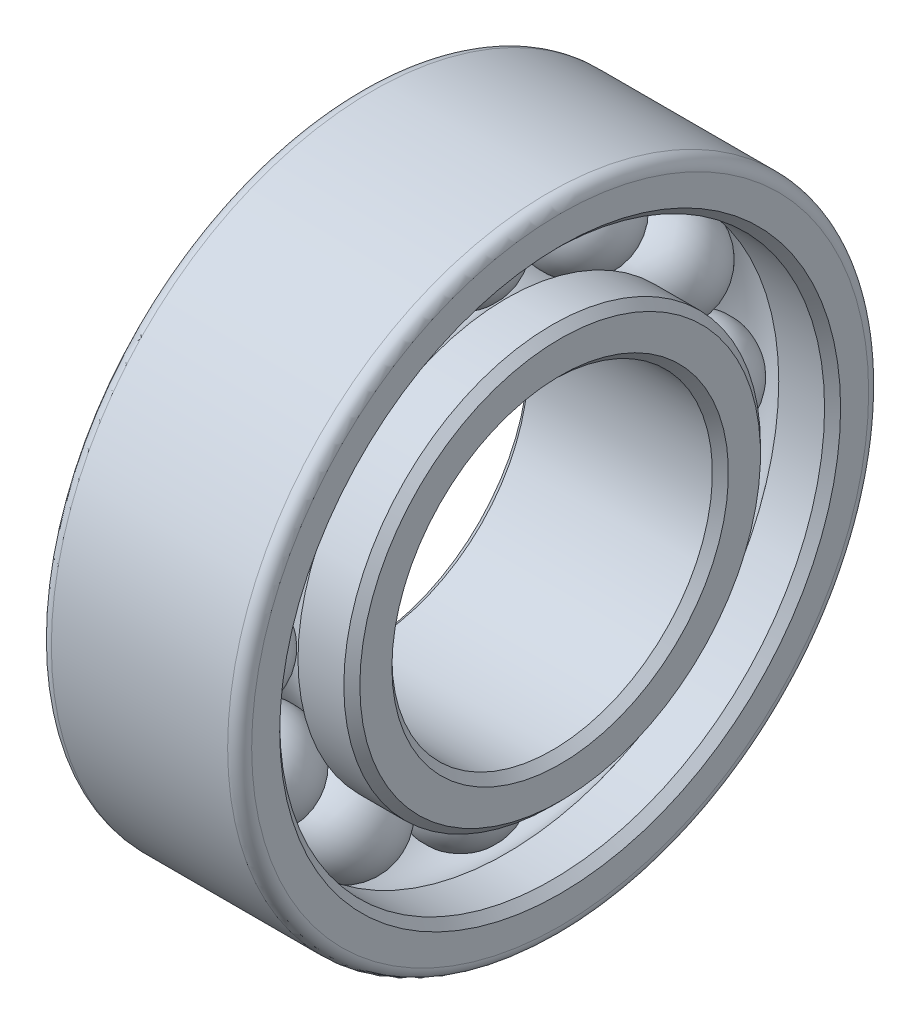
ISO-10303-21;
HEADER;
FILE_DESCRIPTION(('STEP AP214'),'2;1');
FILE_NAME('part.step','',(''),(''),'','','');
FILE_SCHEMA(('AUTOMOTIVE_DESIGN { 1 0 10303 214 1 1 1 1 }'));
ENDSEC;
DATA;
#1=APPLICATION_CONTEXT('core data for automotive mechanical design processes');
#2=APPLICATION_PROTOCOL_DEFINITION('international standard','automotive_design',2000,#1);
#3=PRODUCT_CONTEXT('',#1,'mechanical');
#4=PRODUCT('Part','Part','',(#3));
#5=PRODUCT_RELATED_PRODUCT_CATEGORY('part','',(#4));
#6=PRODUCT_DEFINITION_FORMATION('','',#4);
#7=PRODUCT_DEFINITION_CONTEXT('part definition',#1,'design');
#8=PRODUCT_DEFINITION('design','',#6,#7);
#9=PRODUCT_DEFINITION_SHAPE('','',#8);
#10=(LENGTH_UNIT() NAMED_UNIT(*) SI_UNIT(.MILLI.,.METRE.));
#11=(NAMED_UNIT(*) PLANE_ANGLE_UNIT() SI_UNIT($,.RADIAN.));
#12=(NAMED_UNIT(*) SI_UNIT($,.STERADIAN.) SOLID_ANGLE_UNIT());
#13=UNCERTAINTY_MEASURE_WITH_UNIT(LENGTH_MEASURE(1.E-05),#10,'distance_accuracy_value','');
#14=(GEOMETRIC_REPRESENTATION_CONTEXT(3) GLOBAL_UNCERTAINTY_ASSIGNED_CONTEXT((#13)) GLOBAL_UNIT_ASSIGNED_CONTEXT((#10,
#11,#12)) REPRESENTATION_CONTEXT('',''));
#15=CARTESIAN_POINT('',(0.,0.,0.));
#16=DIRECTION('',(0.,0.,1.));
#17=DIRECTION('',(1.,0.,0.));
#18=AXIS2_PLACEMENT_3D('',#15,#16,#17);
#19=CARTESIAN_POINT('',(2.51062289614978,1.06849757774923,2.9262984409004));
#20=DIRECTION('',(0.,0.866025403784445,0.499999999999989));
#21=DIRECTION('',(-1.,0.,0.));
#22=AXIS2_PLACEMENT_3D('',#19,#20,#21);
#23=SPHERICAL_SURFACE('',#22,1.25);
#24=CARTESIAN_POINT('',(2.51062289614978,2.15102933247978,3.55129844090038));
#25=VERTEX_POINT('',#24);
#26=VERTEX_LOOP('',#25);
#27=FACE_BOUND('',#26,.T.);
#28=ADVANCED_FACE('F39',(#27),#23,.T.);
#29=CLOSED_SHELL('',(#28));
#30=MANIFOLD_SOLID_BREP('B2',#29);
#31=CARTESIAN_POINT('',(2.51062289614978,-1.07370155909948,5.06849757774915));
#32=DIRECTION('',(0.,0.50000000000001,0.866025403784433));
#33=DIRECTION('',(-1.,0.,0.));
#34=AXIS2_PLACEMENT_3D('',#31,#32,#33);
#35=SPHERICAL_SURFACE('',#34,1.25);
#36=CARTESIAN_POINT('',(2.51062289614978,-0.448701559099468,6.1510293324797));
#37=VERTEX_POINT('',#36);
#38=VERTEX_LOOP('',#37);
#39=FACE_BOUND('',#38,.T.);
#40=ADVANCED_FACE('F59',(#39),#35,.T.);
#41=CLOSED_SHELL('',(#40));
#42=MANIFOLD_SOLID_BREP('B6',#41);
#43=CARTESIAN_POINT('',(2.51062289614978,-3.99999999999994,5.85259688180092));
#44=DIRECTION('',(0.,0.,1.));
#45=DIRECTION('',(-1.,0.,0.));
#46=AXIS2_PLACEMENT_3D('',#43,#44,#45);
#47=SPHERICAL_SURFACE('',#46,1.25);
#48=CARTESIAN_POINT('',(2.51062289614978,-3.99999999999993,7.10259688180092));
#49=VERTEX_POINT('',#48);
#50=VERTEX_LOOP('',#49);
#51=FACE_BOUND('',#50,.T.);
#52=ADVANCED_FACE('F79',(#51),#47,.T.);
#53=CLOSED_SHELL('',(#52));
#54=MANIFOLD_SOLID_BREP('B35',#53);
#55=CARTESIAN_POINT('',(2.51062289614978,-6.92629844090041,5.06849757774922));
#56=DIRECTION('',(0.,-0.499999999999992,0.866025403784443));
#57=DIRECTION('',(-1.,0.,0.));
#58=AXIS2_PLACEMENT_3D('',#55,#56,#57);
#59=SPHERICAL_SURFACE('',#58,1.25);
#60=CARTESIAN_POINT('',(2.51062289614978,-7.5512984409004,6.15102933247977));
#61=VERTEX_POINT('',#60);
#62=VERTEX_LOOP('',#61);
#63=FACE_BOUND('',#62,.T.);
#64=ADVANCED_FACE('F99',(#63),#59,.T.);
#65=CLOSED_SHELL('',(#64));
#66=MANIFOLD_SOLID_BREP('B55',#65);
#67=CARTESIAN_POINT('',(2.51062289614978,-9.06849757774916,2.9262984409005));
#68=DIRECTION('',(0.,-0.866025403784435,0.500000000000007));
#69=DIRECTION('',(-1.,0.,0.));
#70=AXIS2_PLACEMENT_3D('',#67,#68,#69);
#71=SPHERICAL_SURFACE('',#70,1.25);
#72=CARTESIAN_POINT('',(2.51062289614978,-10.1510293324797,3.55129844090051));
#73=VERTEX_POINT('',#72);
#74=VERTEX_LOOP('',#73);
#75=FACE_BOUND('',#74,.T.);
#76=ADVANCED_FACE('F119',(#75),#71,.T.);
#77=CLOSED_SHELL('',(#76));
#78=MANIFOLD_SOLID_BREP('B75',#77);
#79=CARTESIAN_POINT('',(2.51062289614978,-9.85259688180092,0.));
#80=DIRECTION('',(0.,-1.,0.));
#81=DIRECTION('',(-1.,0.,0.));
#82=AXIS2_PLACEMENT_3D('',#79,#80,#81);
#83=SPHERICAL_SURFACE('',#82,1.25);
#84=CARTESIAN_POINT('',(2.51062289614978,-11.1025968818009,0.));
#85=VERTEX_POINT('',#84);
#86=VERTEX_LOOP('',#85);
#87=FACE_BOUND('',#86,.T.);
#88=ADVANCED_FACE('F139',(#87),#83,.T.);
#89=CLOSED_SHELL('',(#88));
#90=MANIFOLD_SOLID_BREP('B95',#89);
#91=CARTESIAN_POINT('',(2.51062289614978,-9.06849757774921,-2.92629844090043));
#92=DIRECTION('',(0.,-0.866025403784442,-0.499999999999995));
#93=DIRECTION('',(-1.,0.,0.));
#94=AXIS2_PLACEMENT_3D('',#91,#92,#93);
#95=SPHERICAL_SURFACE('',#94,1.25);
#96=CARTESIAN_POINT('',(2.51062289614978,-10.1510293324798,-3.55129844090042));
#97=VERTEX_POINT('',#96);
#98=VERTEX_LOOP('',#97);
#99=FACE_BOUND('',#98,.T.);
#100=ADVANCED_FACE('F159',(#99),#95,.T.);
#101=CLOSED_SHELL('',(#100));
#102=MANIFOLD_SOLID_BREP('B115',#101);
#103=CARTESIAN_POINT('',(2.51062289614978,-6.92629844090048,-5.06849757774918));
#104=DIRECTION('',(0.,-0.500000000000004,-0.866025403784436));
#105=DIRECTION('',(-1.,0.,0.));
#106=AXIS2_PLACEMENT_3D('',#103,#104,#105);
#107=SPHERICAL_SURFACE('',#106,1.25);
#108=CARTESIAN_POINT('',(2.51062289614978,-7.55129844090049,-6.15102933247972));
#109=VERTEX_POINT('',#108);
#110=VERTEX_LOOP('',#109);
#111=FACE_BOUND('',#110,.T.);
#112=ADVANCED_FACE('F179',(#111),#107,.T.);
#113=CLOSED_SHELL('',(#112));
#114=MANIFOLD_SOLID_BREP('B135',#113);
#115=CARTESIAN_POINT('',(2.51062289614978,-4.00000000000002,-5.85259688180092));
#116=DIRECTION('',(0.,0.,-1.));
#117=DIRECTION('',(-1.,0.,0.));
#118=AXIS2_PLACEMENT_3D('',#115,#116,#117);
#119=SPHERICAL_SURFACE('',#118,1.25);
#120=CARTESIAN_POINT('',(2.51062289614978,-4.00000000000002,-7.10259688180092));
#121=VERTEX_POINT('',#120);
#122=VERTEX_LOOP('',#121);
#123=FACE_BOUND('',#122,.T.);
#124=ADVANCED_FACE('F199',(#123),#119,.T.);
#125=CLOSED_SHELL('',(#124));
#126=MANIFOLD_SOLID_BREP('B155',#125);
#127=CARTESIAN_POINT('',(2.51062289614978,-1.07370155909955,-5.0684975777492));
#128=DIRECTION('',(0.,0.499999999999998,-0.86602540378444));
#129=DIRECTION('',(-1.,0.,0.));
#130=AXIS2_PLACEMENT_3D('',#127,#128,#129);
#131=SPHERICAL_SURFACE('',#130,1.25);
#132=CARTESIAN_POINT('',(2.51062289614978,-0.448701559099554,-6.15102933247975));
#133=VERTEX_POINT('',#132);
#134=VERTEX_LOOP('',#133);
#135=FACE_BOUND('',#134,.T.);
#136=ADVANCED_FACE('F219',(#135),#131,.T.);
#137=CLOSED_SHELL('',(#136));
#138=MANIFOLD_SOLID_BREP('B175',#137);
#139=CARTESIAN_POINT('',(2.51062289614978,1.06849757774919,-2.92629844090047));
#140=DIRECTION('',(0.,0.866025403784438,-0.500000000000001));
#141=DIRECTION('',(-1.,0.,0.));
#142=AXIS2_PLACEMENT_3D('',#139,#140,#141);
#143=SPHERICAL_SURFACE('',#142,1.25);
#144=CARTESIAN_POINT('',(2.51062289614978,2.15102933247973,-3.55129844090047));
#145=VERTEX_POINT('',#144);
#146=VERTEX_LOOP('',#145);
#147=FACE_BOUND('',#146,.T.);
#148=ADVANCED_FACE('F239',(#147),#143,.T.);
#149=CLOSED_SHELL('',(#148));
#150=MANIFOLD_SOLID_BREP('B195',#149);
#151=CARTESIAN_POINT('',(2.51062289614978,1.85259688180092,0.));
#152=DIRECTION('',(0.,1.,0.));
#153=DIRECTION('',(-1.,0.,0.));
#154=AXIS2_PLACEMENT_3D('',#151,#152,#153);
#155=SPHERICAL_SURFACE('',#154,1.25);
#156=CARTESIAN_POINT('',(2.51062289614978,3.10259688180092,0.));
#157=VERTEX_POINT('',#156);
#158=VERTEX_LOOP('',#157);
#159=FACE_BOUND('',#158,.T.);
#160=ADVANCED_FACE('F261',(#159),#155,.T.);
#161=CLOSED_SHELL('',(#160));
#162=MANIFOLD_SOLID_BREP('B215',#161);
#163=CARTESIAN_POINT('',(0.,2.8,0.));
#164=DIRECTION('',(1.,0.,0.));
#165=DIRECTION('',(0.,0.,-1.));
#166=AXIS2_PLACEMENT_3D('',#163,#164,#165);
#167=PLANE('',#166);
#168=CARTESIAN_POINT('',(0.,-4.,0.));
#169=DIRECTION('',(1.,0.,0.));
#170=DIRECTION('',(0.,0.,-1.));
#171=AXIS2_PLACEMENT_3D('',#168,#169,#170);
#172=CIRCLE('',#171,7.);
#173=CARTESIAN_POINT('',(0.,-4.,-7.));
#174=VERTEX_POINT('',#173);
#175=EDGE_CURVE('E260',#174,#174,#172,.T.);
#176=ORIENTED_EDGE('',*,*,#175,.T.);
#177=EDGE_LOOP('',(#176));
#178=FACE_BOUND('',#177,.T.);
#179=CARTESIAN_POINT('',(0.,-4.,0.));
#180=DIRECTION('',(1.,0.,0.));
#181=DIRECTION('',(0.,0.,-1.));
#182=AXIS2_PLACEMENT_3D('',#179,#180,#181);
#183=CIRCLE('',#182,7.7);
#184=CARTESIAN_POINT('',(0.,-4.,-7.7));
#185=VERTEX_POINT('',#184);
#186=EDGE_CURVE('E300',#185,#185,#183,.F.);
#187=ORIENTED_EDGE('',*,*,#186,.T.);
#188=EDGE_LOOP('',(#187));
#189=FACE_BOUND('',#188,.T.);
#190=ADVANCED_FACE('F280',(#178,#189),#167,.F.);
#191=CARTESIAN_POINT('',(-1.0669014084507,-4.,0.));
#192=DIRECTION('',(-1.,0.,0.));
#193=DIRECTION('',(0.,0.,1.));
#194=AXIS2_PLACEMENT_3D('',#191,#192,#193);
#195=CYLINDRICAL_SURFACE('',#194,6.8);
#196=CARTESIAN_POINT('',(0.199999999999998,-4.,0.));
#197=DIRECTION('',(1.,0.,0.));
#198=DIRECTION('',(0.,0.,-1.));
#199=AXIS2_PLACEMENT_3D('',#196,#197,#198);
#200=CIRCLE('',#199,6.8);
#201=CARTESIAN_POINT('',(0.199999999999998,-4.,-6.8));
#202=VERTEX_POINT('',#201);
#203=EDGE_CURVE('E287',#202,#202,#200,.F.);
#204=ORIENTED_EDGE('',*,*,#203,.T.);
#205=EDGE_LOOP('',(#204));
#206=FACE_BOUND('',#205,.T.);
#207=CARTESIAN_POINT('',(1.36487620741247,-4.,0.));
#208=DIRECTION('',(-1.,0.,0.));
#209=DIRECTION('',(0.,0.,1.));
#210=AXIS2_PLACEMENT_3D('',#207,#208,#209);
#211=CIRCLE('',#210,6.8);
#212=CARTESIAN_POINT('',(1.36487620741247,-4.,6.8));
#213=VERTEX_POINT('',#212);
#214=EDGE_CURVE('E312',#213,#213,#211,.T.);
#215=ORIENTED_EDGE('',*,*,#214,.F.);
#216=EDGE_LOOP('',(#215));
#217=FACE_BOUND('',#216,.T.);
#218=ADVANCED_FACE('F324',(#206,#217),#195,.F.);
#219=CARTESIAN_POINT('',(2.51062289614978,-4.,0.));
#220=DIRECTION('',(-1.,0.,0.));
#221=DIRECTION('',(0.,0.,1.));
#222=AXIS2_PLACEMENT_3D('',#219,#220,#221);
#223=TOROIDAL_SURFACE('',#222,6.,1.39740311819908);
#224=CARTESIAN_POINT('',(3.65636958488709,-4.,0.));
#225=DIRECTION('',(-1.,0.,0.));
#226=DIRECTION('',(0.,0.,1.));
#227=AXIS2_PLACEMENT_3D('',#224,#225,#226);
#228=CIRCLE('',#227,6.8);
#229=CARTESIAN_POINT('',(3.65636958488709,-4.,6.8));
#230=VERTEX_POINT('',#229);
#231=EDGE_CURVE('E315',#230,#230,#228,.T.);
#232=ORIENTED_EDGE('',*,*,#231,.F.);
#233=EDGE_LOOP('',(#232));
#234=FACE_BOUND('',#233,.T.);
#235=ORIENTED_EDGE('',*,*,#214,.T.);
#236=EDGE_LOOP('',(#235));
#237=FACE_BOUND('',#236,.T.);
#238=ADVANCED_FACE('F321',(#234,#237),#223,.F.);
#239=CARTESIAN_POINT('',(-1.0669014084507,-4.,0.));
#240=DIRECTION('',(-1.,0.,0.));
#241=DIRECTION('',(0.,0.,1.));
#242=AXIS2_PLACEMENT_3D('',#239,#240,#241);
#243=CYLINDRICAL_SURFACE('',#242,6.8);
#244=CARTESIAN_POINT('',(4.8,-4.,0.));
#245=DIRECTION('',(-1.,0.,0.));
#246=DIRECTION('',(0.,0.,1.));
#247=AXIS2_PLACEMENT_3D('',#244,#245,#246);
#248=CIRCLE('',#247,6.8);
#249=CARTESIAN_POINT('',(4.8,-4.,6.8));
#250=VERTEX_POINT('',#249);
#251=EDGE_CURVE('E291',#250,#250,#248,.F.);
#252=ORIENTED_EDGE('',*,*,#251,.T.);
#253=EDGE_LOOP('',(#252));
#254=FACE_BOUND('',#253,.T.);
#255=ORIENTED_EDGE('',*,*,#231,.T.);
#256=EDGE_LOOP('',(#255));
#257=FACE_BOUND('',#256,.T.);
#258=ADVANCED_FACE('F319',(#254,#257),#243,.F.);
#259=CARTESIAN_POINT('',(5.,2.8,0.));
#260=DIRECTION('',(-1.,0.,0.));
#261=DIRECTION('',(0.,0.,1.));
#262=AXIS2_PLACEMENT_3D('',#259,#260,#261);
#263=PLANE('',#262);
#264=CARTESIAN_POINT('',(5.,-4.,0.));
#265=DIRECTION('',(-1.,0.,0.));
#266=DIRECTION('',(0.,0.,1.));
#267=AXIS2_PLACEMENT_3D('',#264,#265,#266);
#268=CIRCLE('',#267,7.);
#269=CARTESIAN_POINT('',(5.,-4.,7.));
#270=VERTEX_POINT('',#269);
#271=EDGE_CURVE('E295',#270,#270,#268,.T.);
#272=ORIENTED_EDGE('',*,*,#271,.T.);
#273=EDGE_LOOP('',(#272));
#274=FACE_BOUND('',#273,.T.);
#275=CARTESIAN_POINT('',(5.,-4.,0.));
#276=DIRECTION('',(-1.,0.,0.));
#277=DIRECTION('',(0.,0.,1.));
#278=AXIS2_PLACEMENT_3D('',#275,#276,#277);
#279=CIRCLE('',#278,7.7);
#280=CARTESIAN_POINT('',(5.,-4.,7.7));
#281=VERTEX_POINT('',#280);
#282=EDGE_CURVE('E303',#281,#281,#279,.F.);
#283=ORIENTED_EDGE('',*,*,#282,.T.);
#284=EDGE_LOOP('',(#283));
#285=FACE_BOUND('',#284,.T.);
#286=ADVANCED_FACE('F355',(#274,#285),#263,.F.);
#287=CARTESIAN_POINT('',(-1.0669014084507,-4.,0.));
#288=DIRECTION('',(-1.,0.,0.));
#289=DIRECTION('',(0.,0.,1.));
#290=AXIS2_PLACEMENT_3D('',#287,#288,#289);
#291=CYLINDRICAL_SURFACE('',#290,8.);
#292=CARTESIAN_POINT('',(4.7,-4.,0.));
#293=DIRECTION('',(-1.,0.,0.));
#294=DIRECTION('',(0.,0.,1.));
#295=AXIS2_PLACEMENT_3D('',#292,#293,#294);
#296=CIRCLE('',#295,8.);
#297=CARTESIAN_POINT('',(4.7,-4.,8.));
#298=VERTEX_POINT('',#297);
#299=EDGE_CURVE('E306',#298,#298,#296,.T.);
#300=ORIENTED_EDGE('',*,*,#299,.T.);
#301=EDGE_LOOP('',(#300));
#302=FACE_BOUND('',#301,.T.);
#303=CARTESIAN_POINT('',(0.3,-4.,0.));
#304=DIRECTION('',(1.,0.,0.));
#305=DIRECTION('',(0.,0.,-1.));
#306=AXIS2_PLACEMENT_3D('',#303,#304,#305);
#307=CIRCLE('',#306,8.);
#308=CARTESIAN_POINT('',(0.3,-4.,-8.));
#309=VERTEX_POINT('',#308);
#310=EDGE_CURVE('E309',#309,#309,#307,.T.);
#311=ORIENTED_EDGE('',*,*,#310,.T.);
#312=EDGE_LOOP('',(#311));
#313=FACE_BOUND('',#312,.T.);
#314=ADVANCED_FACE('F340',(#302,#313),#291,.T.);
#315=CARTESIAN_POINT('',(4.7,-4.,0.));
#316=DIRECTION('',(-1.,0.,0.));
#317=DIRECTION('',(0.,0.,1.));
#318=AXIS2_PLACEMENT_3D('',#315,#316,#317);
#319=TOROIDAL_SURFACE('',#318,7.7,0.3);
#320=ORIENTED_EDGE('',*,*,#282,.F.);
#321=EDGE_LOOP('',(#320));
#322=FACE_BOUND('',#321,.T.);
#323=ORIENTED_EDGE('',*,*,#299,.F.);
#324=EDGE_LOOP('',(#323));
#325=FACE_BOUND('',#324,.T.);
#326=ADVANCED_FACE('F336',(#322,#325),#319,.T.);
#327=CARTESIAN_POINT('',(0.3,-4.,0.));
#328=DIRECTION('',(1.,0.,0.));
#329=DIRECTION('',(0.,0.,-1.));
#330=AXIS2_PLACEMENT_3D('',#327,#328,#329);
#331=TOROIDAL_SURFACE('',#330,7.7,0.3);
#332=ORIENTED_EDGE('',*,*,#310,.F.);
#333=EDGE_LOOP('',(#332));
#334=FACE_BOUND('',#333,.T.);
#335=ORIENTED_EDGE('',*,*,#186,.F.);
#336=EDGE_LOOP('',(#335));
#337=FACE_BOUND('',#336,.T.);
#338=ADVANCED_FACE('F339',(#334,#337),#331,.T.);
#339=CARTESIAN_POINT('',(5.,-4.,0.));
#340=DIRECTION('',(1.,0.,0.));
#341=DIRECTION('',(0.,0.,-1.));
#342=AXIS2_PLACEMENT_3D('',#339,#340,#341);
#343=CONICAL_SURFACE('',#342,7.,0.785398163397442);
#344=ORIENTED_EDGE('',*,*,#251,.F.);
#345=EDGE_LOOP('',(#344));
#346=FACE_BOUND('',#345,.T.);
#347=ORIENTED_EDGE('',*,*,#271,.F.);
#348=EDGE_LOOP('',(#347));
#349=FACE_BOUND('',#348,.T.);
#350=ADVANCED_FACE('F343',(#346,#349),#343,.F.);
#351=CARTESIAN_POINT('',(0.199999999999998,-4.,0.));
#352=DIRECTION('',(-1.,0.,0.));
#353=DIRECTION('',(0.,0.,1.));
#354=AXIS2_PLACEMENT_3D('',#351,#352,#353);
#355=CONICAL_SURFACE('',#354,6.8,0.78539816339745);
#356=ORIENTED_EDGE('',*,*,#175,.F.);
#357=EDGE_LOOP('',(#356));
#358=FACE_BOUND('',#357,.T.);
#359=ORIENTED_EDGE('',*,*,#203,.F.);
#360=EDGE_LOOP('',(#359));
#361=FACE_BOUND('',#360,.T.);
#362=ADVANCED_FACE('F282',(#358,#361),#355,.F.);
#363=CLOSED_SHELL('',(#190,#218,#238,#258,#286,#314,#326,#338,#350,#362));
#364=MANIFOLD_SOLID_BREP('B235',#363);
#365=CARTESIAN_POINT('',(0.,0.,0.));
#366=DIRECTION('',(1.,0.,0.));
#367=DIRECTION('',(0.,0.,-1.));
#368=AXIS2_PLACEMENT_3D('',#365,#366,#367);
#369=PLANE('',#368);
#370=CARTESIAN_POINT('',(0.,-4.,0.));
#371=DIRECTION('',(1.,0.,0.));
#372=DIRECTION('',(0.,0.,-1.));
#373=AXIS2_PLACEMENT_3D('',#370,#371,#372);
#374=CIRCLE('',#373,4.2);
#375=CARTESIAN_POINT('',(0.,-4.,-4.2));
#376=VERTEX_POINT('',#375);
#377=EDGE_CURVE('E455',#376,#376,#374,.T.);
#378=ORIENTED_EDGE('',*,*,#377,.T.);
#379=EDGE_LOOP('',(#378));
#380=FACE_BOUND('',#379,.T.);
#381=CARTESIAN_POINT('',(0.,-4.,0.));
#382=DIRECTION('',(1.,0.,0.));
#383=DIRECTION('',(0.,0.,-1.));
#384=AXIS2_PLACEMENT_3D('',#381,#382,#383);
#385=CIRCLE('',#384,5.);
#386=CARTESIAN_POINT('',(0.,-4.,-5.));
#387=VERTEX_POINT('',#386);
#388=EDGE_CURVE('E458',#387,#387,#385,.F.);
#389=ORIENTED_EDGE('',*,*,#388,.T.);
#390=EDGE_LOOP('',(#389));
#391=FACE_BOUND('',#390,.T.);
#392=ADVANCED_FACE('F435',(#380,#391),#369,.F.);
#393=CARTESIAN_POINT('',(-1.0669014084507,-4.,0.));
#394=DIRECTION('',(-1.,0.,0.));
#395=DIRECTION('',(0.,0.,1.));
#396=AXIS2_PLACEMENT_3D('',#393,#394,#395);
#397=CYLINDRICAL_SURFACE('',#396,4.);
#398=CARTESIAN_POINT('',(0.200000000000001,-4.,0.));
#399=DIRECTION('',(1.,0.,0.));
#400=DIRECTION('',(0.,0.,-1.));
#401=AXIS2_PLACEMENT_3D('',#398,#399,#400);
#402=CIRCLE('',#401,4.);
#403=CARTESIAN_POINT('',(0.200000000000001,-4.,-4.));
#404=VERTEX_POINT('',#403);
#405=EDGE_CURVE('E461',#404,#404,#402,.F.);
#406=ORIENTED_EDGE('',*,*,#405,.T.);
#407=EDGE_LOOP('',(#406));
#408=FACE_BOUND('',#407,.T.);
#409=CARTESIAN_POINT('',(4.8,-4.,0.));
#410=DIRECTION('',(-1.,0.,0.));
#411=DIRECTION('',(0.,0.,1.));
#412=AXIS2_PLACEMENT_3D('',#409,#410,#411);
#413=CIRCLE('',#412,4.);
#414=CARTESIAN_POINT('',(4.8,-4.,4.));
#415=VERTEX_POINT('',#414);
#416=EDGE_CURVE('E464',#415,#415,#413,.F.);
#417=ORIENTED_EDGE('',*,*,#416,.T.);
#418=EDGE_LOOP('',(#417));
#419=FACE_BOUND('',#418,.T.);
#420=ADVANCED_FACE('F489',(#408,#419),#397,.F.);
#421=CARTESIAN_POINT('',(5.,0.,0.));
#422=DIRECTION('',(-1.,0.,0.));
#423=DIRECTION('',(0.,0.,1.));
#424=AXIS2_PLACEMENT_3D('',#421,#422,#423);
#425=PLANE('',#424);
#426=CARTESIAN_POINT('',(5.,-4.,0.));
#427=DIRECTION('',(-1.,0.,0.));
#428=DIRECTION('',(0.,0.,1.));
#429=AXIS2_PLACEMENT_3D('',#426,#427,#428);
#430=CIRCLE('',#429,4.2);
#431=CARTESIAN_POINT('',(5.,-4.,4.2));
#432=VERTEX_POINT('',#431);
#433=EDGE_CURVE('E446',#432,#432,#430,.T.);
#434=ORIENTED_EDGE('',*,*,#433,.T.);
#435=EDGE_LOOP('',(#434));
#436=FACE_BOUND('',#435,.T.);
#437=CARTESIAN_POINT('',(5.,-4.,0.));
#438=DIRECTION('',(-1.,0.,0.));
#439=DIRECTION('',(0.,0.,1.));
#440=AXIS2_PLACEMENT_3D('',#437,#438,#439);
#441=CIRCLE('',#440,5.);
#442=CARTESIAN_POINT('',(5.,-4.,5.));
#443=VERTEX_POINT('',#442);
#444=EDGE_CURVE('E450',#443,#443,#441,.F.);
#445=ORIENTED_EDGE('',*,*,#444,.T.);
#446=EDGE_LOOP('',(#445));
#447=FACE_BOUND('',#446,.T.);
#448=ADVANCED_FACE('F484',(#436,#447),#425,.F.);
#449=CARTESIAN_POINT('',(-1.0669014084507,-4.,0.));
#450=DIRECTION('',(-1.,0.,0.));
#451=DIRECTION('',(0.,0.,1.));
#452=AXIS2_PLACEMENT_3D('',#449,#450,#451);
#453=CYLINDRICAL_SURFACE('',#452,5.2);
#454=CARTESIAN_POINT('',(4.8,-4.,0.));
#455=DIRECTION('',(-1.,0.,0.));
#456=DIRECTION('',(0.,0.,1.));
#457=AXIS2_PLACEMENT_3D('',#454,#455,#456);
#458=CIRCLE('',#457,5.2);
#459=CARTESIAN_POINT('',(4.8,-4.,5.2));
#460=VERTEX_POINT('',#459);
#461=EDGE_CURVE('E442',#460,#460,#458,.T.);
#462=ORIENTED_EDGE('',*,*,#461,.T.);
#463=EDGE_LOOP('',(#462));
#464=FACE_BOUND('',#463,.T.);
#465=CARTESIAN_POINT('',(3.65636958488709,-4.,0.));
#466=DIRECTION('',(-1.,0.,0.));
#467=DIRECTION('',(0.,0.,1.));
#468=AXIS2_PLACEMENT_3D('',#465,#466,#467);
#469=CIRCLE('',#468,5.2);
#470=CARTESIAN_POINT('',(3.65636958488709,-4.,5.2));
#471=VERTEX_POINT('',#470);
#472=EDGE_CURVE('E467',#471,#471,#469,.T.);
#473=ORIENTED_EDGE('',*,*,#472,.F.);
#474=EDGE_LOOP('',(#473));
#475=FACE_BOUND('',#474,.T.);
#476=ADVANCED_FACE('F479',(#464,#475),#453,.T.);
#477=CARTESIAN_POINT('',(2.51062289614978,-4.,0.));
#478=DIRECTION('',(-1.,0.,0.));
#479=DIRECTION('',(0.,0.,1.));
#480=AXIS2_PLACEMENT_3D('',#477,#478,#479);
#481=TOROIDAL_SURFACE('',#480,6.,1.39740311819908);
#482=CARTESIAN_POINT('',(1.36487620741247,-4.,0.));
#483=DIRECTION('',(-1.,0.,0.));
#484=DIRECTION('',(0.,0.,1.));
#485=AXIS2_PLACEMENT_3D('',#482,#483,#484);
#486=CIRCLE('',#485,5.2);
#487=CARTESIAN_POINT('',(1.36487620741247,-4.,5.2));
#488=VERTEX_POINT('',#487);
#489=EDGE_CURVE('E470',#488,#488,#486,.T.);
#490=ORIENTED_EDGE('',*,*,#489,.F.);
#491=EDGE_LOOP('',(#490));
#492=FACE_BOUND('',#491,.T.);
#493=ORIENTED_EDGE('',*,*,#472,.T.);
#494=EDGE_LOOP('',(#493));
#495=FACE_BOUND('',#494,.T.);
#496=ADVANCED_FACE('F476',(#492,#495),#481,.F.);
#497=CARTESIAN_POINT('',(-1.0669014084507,-4.,0.));
#498=DIRECTION('',(-1.,0.,0.));
#499=DIRECTION('',(0.,0.,1.));
#500=AXIS2_PLACEMENT_3D('',#497,#498,#499);
#501=CYLINDRICAL_SURFACE('',#500,5.2);
#502=CARTESIAN_POINT('',(0.200000000000006,-4.,0.));
#503=DIRECTION('',(1.,0.,0.));
#504=DIRECTION('',(0.,0.,-1.));
#505=AXIS2_PLACEMENT_3D('',#502,#503,#504);
#506=CIRCLE('',#505,5.2);
#507=CARTESIAN_POINT('',(0.200000000000006,-4.,-5.2));
#508=VERTEX_POINT('',#507);
#509=EDGE_CURVE('E279',#508,#508,#506,.T.);
#510=ORIENTED_EDGE('',*,*,#509,.T.);
#511=EDGE_LOOP('',(#510));
#512=FACE_BOUND('',#511,.T.);
#513=ORIENTED_EDGE('',*,*,#489,.T.);
#514=EDGE_LOOP('',(#513));
#515=FACE_BOUND('',#514,.T.);
#516=ADVANCED_FACE('F474',(#512,#515),#501,.T.);
#517=CARTESIAN_POINT('',(0.200000000000001,-4.,0.));
#518=DIRECTION('',(-1.,0.,0.));
#519=DIRECTION('',(0.,0.,1.));
#520=AXIS2_PLACEMENT_3D('',#517,#518,#519);
#521=CONICAL_SURFACE('',#520,4.,0.785398163397448);
#522=ORIENTED_EDGE('',*,*,#377,.F.);
#523=EDGE_LOOP('',(#522));
#524=FACE_BOUND('',#523,.T.);
#525=ORIENTED_EDGE('',*,*,#405,.F.);
#526=EDGE_LOOP('',(#525));
#527=FACE_BOUND('',#526,.T.);
#528=ADVANCED_FACE('F502',(#524,#527),#521,.F.);
#529=CARTESIAN_POINT('',(5.,-4.,0.));
#530=DIRECTION('',(1.,0.,0.));
#531=DIRECTION('',(0.,0.,-1.));
#532=AXIS2_PLACEMENT_3D('',#529,#530,#531);
#533=CONICAL_SURFACE('',#532,4.2,0.785398163397442);
#534=ORIENTED_EDGE('',*,*,#416,.F.);
#535=EDGE_LOOP('',(#534));
#536=FACE_BOUND('',#535,.T.);
#537=ORIENTED_EDGE('',*,*,#433,.F.);
#538=EDGE_LOOP('',(#537));
#539=FACE_BOUND('',#538,.T.);
#540=ADVANCED_FACE('F505',(#536,#539),#533,.F.);
#541=CARTESIAN_POINT('',(4.8,-4.,0.));
#542=DIRECTION('',(-1.,0.,0.));
#543=DIRECTION('',(0.,0.,1.));
#544=AXIS2_PLACEMENT_3D('',#541,#542,#543);
#545=CONICAL_SURFACE('',#544,5.2,0.78539816339745);
#546=ORIENTED_EDGE('',*,*,#444,.F.);
#547=EDGE_LOOP('',(#546));
#548=FACE_BOUND('',#547,.T.);
#549=ORIENTED_EDGE('',*,*,#461,.F.);
#550=EDGE_LOOP('',(#549));
#551=FACE_BOUND('',#550,.T.);
#552=ADVANCED_FACE('F508',(#548,#551),#545,.T.);
#553=CARTESIAN_POINT('',(0.,-4.,0.));
#554=DIRECTION('',(1.,0.,0.));
#555=DIRECTION('',(0.,0.,-1.));
#556=AXIS2_PLACEMENT_3D('',#553,#554,#555);
#557=CONICAL_SURFACE('',#556,5.,0.785398163397444);
#558=ORIENTED_EDGE('',*,*,#509,.F.);
#559=EDGE_LOOP('',(#558));
#560=FACE_BOUND('',#559,.T.);
#561=ORIENTED_EDGE('',*,*,#388,.F.);
#562=EDGE_LOOP('',(#561));
#563=FACE_BOUND('',#562,.T.);
#564=ADVANCED_FACE('F437',(#560,#563),#557,.T.);
#565=CLOSED_SHELL('',(#392,#420,#448,#476,#496,#516,#528,#540,#552,#564));
#566=MANIFOLD_SOLID_BREP('B255',#565);
#567=ADVANCED_BREP_SHAPE_REPRESENTATION('',(#18,#30,#42,#54,#66,#78,#90,#102,#114,#126,#138,
#150,#162,#364,#566),#14);
#568=SHAPE_DEFINITION_REPRESENTATION(#9,#567);
ENDSEC;
END-ISO-10303-21;
